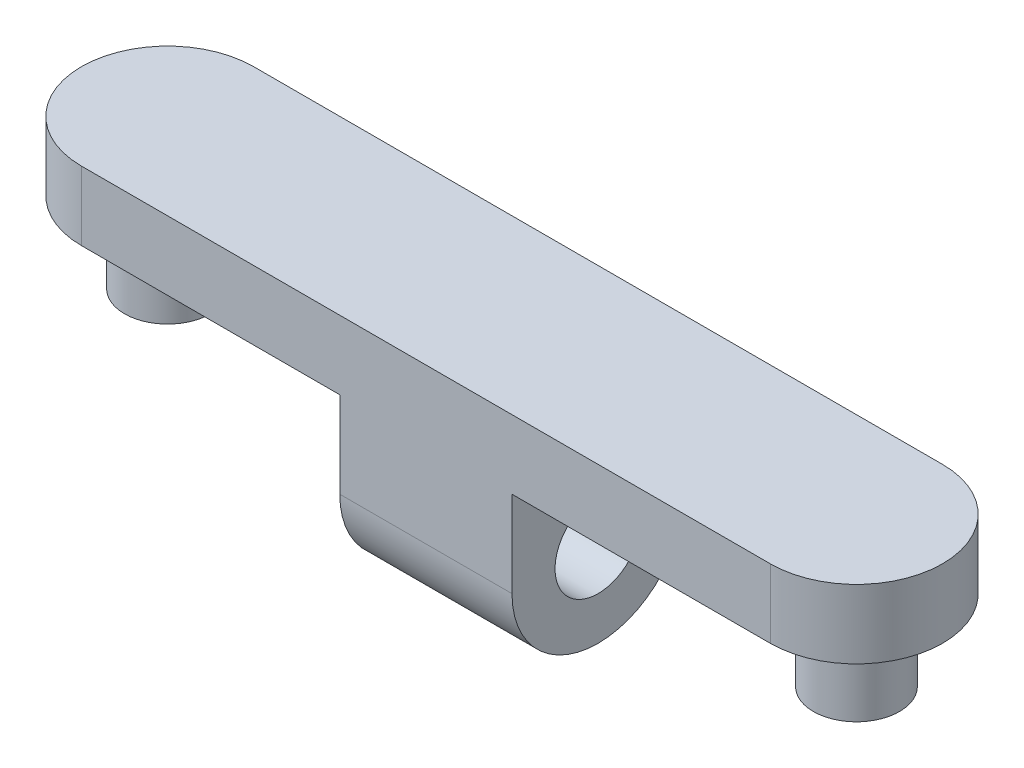
ISO-10303-21;
HEADER;
FILE_DESCRIPTION(('STEP AP214'),'2;1');
FILE_NAME('part.step','',(''),(''),'','','');
FILE_SCHEMA(('AUTOMOTIVE_DESIGN { 1 0 10303 214 1 1 1 1 }'));
ENDSEC;
DATA;
#1=APPLICATION_CONTEXT('core data for automotive mechanical design processes');
#2=APPLICATION_PROTOCOL_DEFINITION('international standard','automotive_design',2000,#1);
#3=PRODUCT_CONTEXT('',#1,'mechanical');
#4=PRODUCT('Part','Part','',(#3));
#5=PRODUCT_RELATED_PRODUCT_CATEGORY('part','',(#4));
#6=PRODUCT_DEFINITION_FORMATION('','',#4);
#7=PRODUCT_DEFINITION_CONTEXT('part definition',#1,'design');
#8=PRODUCT_DEFINITION('design','',#6,#7);
#9=PRODUCT_DEFINITION_SHAPE('','',#8);
#10=(LENGTH_UNIT() NAMED_UNIT(*) SI_UNIT(.MILLI.,.METRE.));
#11=(NAMED_UNIT(*) PLANE_ANGLE_UNIT() SI_UNIT($,.RADIAN.));
#12=(NAMED_UNIT(*) SI_UNIT($,.STERADIAN.) SOLID_ANGLE_UNIT());
#13=UNCERTAINTY_MEASURE_WITH_UNIT(LENGTH_MEASURE(1.E-05),#10,'distance_accuracy_value','');
#14=(GEOMETRIC_REPRESENTATION_CONTEXT(3) GLOBAL_UNCERTAINTY_ASSIGNED_CONTEXT((#13)) GLOBAL_UNIT_ASSIGNED_CONTEXT((#10,
#11,#12)) REPRESENTATION_CONTEXT('',''));
#15=CARTESIAN_POINT('',(0.,0.,0.));
#16=DIRECTION('',(0.,0.,1.));
#17=DIRECTION('',(1.,0.,0.));
#18=AXIS2_PLACEMENT_3D('',#15,#16,#17);
#19=CARTESIAN_POINT('',(-12.7,0.,0.));
#20=DIRECTION('',(0.,1.,0.));
#21=DIRECTION('',(0.,0.,1.));
#22=AXIS2_PLACEMENT_3D('',#19,#20,#21);
#23=PLANE('',#22);
#24=CARTESIAN_POINT('',(12.7,0.,0.));
#25=DIRECTION('',(0.,1.,0.));
#26=DIRECTION('',(0.,0.,1.));
#27=AXIS2_PLACEMENT_3D('',#24,#25,#26);
#28=CIRCLE('',#27,1.5875);
#29=CARTESIAN_POINT('',(12.7,0.,1.5875));
#30=VERTEX_POINT('',#29);
#31=EDGE_CURVE('E154',#30,#30,#28,.T.);
#32=ORIENTED_EDGE('',*,*,#31,.T.);
#33=EDGE_LOOP('',(#32));
#34=FACE_BOUND('',#33,.T.);
#35=DIRECTION('',(0.,0.,1.));
#36=VECTOR('',#35,1.);
#37=CARTESIAN_POINT('',(3.175,0.,-3.175));
#38=LINE('',#37,#36);
#39=CARTESIAN_POINT('',(3.175,0.,-3.175));
#40=VERTEX_POINT('',#39);
#41=CARTESIAN_POINT('',(3.17499999999999,0.,3.175));
#42=VERTEX_POINT('',#41);
#43=EDGE_CURVE('E111',#40,#42,#38,.T.);
#44=ORIENTED_EDGE('',*,*,#43,.F.);
#45=DIRECTION('',(1.,0.,0.));
#46=VECTOR('',#45,1.);
#47=CARTESIAN_POINT('',(-12.7,0.,-3.175));
#48=LINE('',#47,#46);
#49=CARTESIAN_POINT('',(12.7,0.,-3.17500000000001));
#50=VERTEX_POINT('',#49);
#51=EDGE_CURVE('E119',#40,#50,#48,.T.);
#52=ORIENTED_EDGE('',*,*,#51,.T.);
#53=CARTESIAN_POINT('',(12.7,0.,0.));
#54=DIRECTION('',(0.,1.,0.));
#55=DIRECTION('',(0.,0.,1.));
#56=AXIS2_PLACEMENT_3D('',#53,#54,#55);
#57=CIRCLE('',#56,3.175);
#58=CARTESIAN_POINT('',(12.7,0.,3.175));
#59=VERTEX_POINT('',#58);
#60=EDGE_CURVE('E129',#59,#50,#57,.T.);
#61=ORIENTED_EDGE('',*,*,#60,.F.);
#62=DIRECTION('',(1.,0.,0.));
#63=VECTOR('',#62,1.);
#64=CARTESIAN_POINT('',(-12.7,0.,3.175));
#65=LINE('',#64,#63);
#66=EDGE_CURVE('E132',#42,#59,#65,.T.);
#67=ORIENTED_EDGE('',*,*,#66,.F.);
#68=EDGE_LOOP('',(#44,#52,#61,#67));
#69=FACE_BOUND('',#68,.T.);
#70=ADVANCED_FACE('F40',(#34,#69),#23,.F.);
#71=CARTESIAN_POINT('',(-12.7,0.,0.));
#72=DIRECTION('',(0.,1.,0.));
#73=DIRECTION('',(0.,0.,1.));
#74=AXIS2_PLACEMENT_3D('',#71,#72,#73);
#75=CIRCLE('',#74,1.5875);
#76=CARTESIAN_POINT('',(-12.7,0.,1.5875));
#77=VERTEX_POINT('',#76);
#78=EDGE_CURVE('E158',#77,#77,#75,.T.);
#79=ORIENTED_EDGE('',*,*,#78,.T.);
#80=EDGE_LOOP('',(#79));
#81=FACE_BOUND('',#80,.T.);
#82=DIRECTION('',(0.,0.,-1.));
#83=VECTOR('',#82,1.);
#84=CARTESIAN_POINT('',(-3.175,0.,-3.175));
#85=LINE('',#84,#83);
#86=CARTESIAN_POINT('',(-3.175,0.,3.175));
#87=VERTEX_POINT('',#86);
#88=CARTESIAN_POINT('',(-3.175,0.,-3.17500000000001));
#89=VERTEX_POINT('',#88);
#90=EDGE_CURVE('E116',#87,#89,#85,.T.);
#91=ORIENTED_EDGE('',*,*,#90,.F.);
#92=CARTESIAN_POINT('',(-12.7,0.,3.175));
#93=VERTEX_POINT('',#92);
#94=EDGE_CURVE('E187',#93,#87,#65,.T.);
#95=ORIENTED_EDGE('',*,*,#94,.F.);
#96=CARTESIAN_POINT('',(-12.7,0.,0.));
#97=DIRECTION('',(0.,1.,0.));
#98=DIRECTION('',(0.,0.,1.));
#99=AXIS2_PLACEMENT_3D('',#96,#97,#98);
#100=CIRCLE('',#99,3.175);
#101=CARTESIAN_POINT('',(-12.7,0.,-3.175));
#102=VERTEX_POINT('',#101);
#103=EDGE_CURVE('E166',#102,#93,#100,.T.);
#104=ORIENTED_EDGE('',*,*,#103,.F.);
#105=EDGE_CURVE('E128',#102,#89,#48,.T.);
#106=ORIENTED_EDGE('',*,*,#105,.T.);
#107=EDGE_LOOP('',(#91,#95,#104,#106));
#108=FACE_BOUND('',#107,.T.);
#109=ADVANCED_FACE('F239',(#81,#108),#23,.F.);
#110=CARTESIAN_POINT('',(-12.7,2.54,0.));
#111=DIRECTION('',(0.,-1.,0.));
#112=DIRECTION('',(0.,0.,-1.));
#113=AXIS2_PLACEMENT_3D('',#110,#111,#112);
#114=CYLINDRICAL_SURFACE('',#113,3.175);
#115=ORIENTED_EDGE('',*,*,#103,.T.);
#116=DIRECTION('',(0.,-1.,0.));
#117=VECTOR('',#116,1.);
#118=CARTESIAN_POINT('',(-12.7,2.54,3.175));
#119=LINE('',#118,#117);
#120=CARTESIAN_POINT('',(-12.7,2.54,3.175));
#121=VERTEX_POINT('',#120);
#122=EDGE_CURVE('E203',#121,#93,#119,.T.);
#123=ORIENTED_EDGE('',*,*,#122,.F.);
#124=CARTESIAN_POINT('',(-12.7,2.54,0.));
#125=DIRECTION('',(0.,1.,0.));
#126=DIRECTION('',(0.,0.,1.));
#127=AXIS2_PLACEMENT_3D('',#124,#125,#126);
#128=CIRCLE('',#127,3.175);
#129=CARTESIAN_POINT('',(-12.7,2.54,-3.175));
#130=VERTEX_POINT('',#129);
#131=EDGE_CURVE('E170',#130,#121,#128,.T.);
#132=ORIENTED_EDGE('',*,*,#131,.F.);
#133=DIRECTION('',(0.,-1.,0.));
#134=VECTOR('',#133,1.);
#135=CARTESIAN_POINT('',(-12.7,2.54,-3.175));
#136=LINE('',#135,#134);
#137=EDGE_CURVE('E183',#130,#102,#136,.T.);
#138=ORIENTED_EDGE('',*,*,#137,.T.);
#139=EDGE_LOOP('',(#115,#123,#132,#138));
#140=FACE_BOUND('',#139,.T.);
#141=ADVANCED_FACE('F235',(#140),#114,.T.);
#142=CARTESIAN_POINT('',(-12.7,2.54,3.175));
#143=DIRECTION('',(0.,0.,-1.));
#144=DIRECTION('',(-1.,0.,0.));
#145=AXIS2_PLACEMENT_3D('',#142,#143,#144);
#146=PLANE('',#145);
#147=DIRECTION('',(0.,1.,0.));
#148=VECTOR('',#147,1.);
#149=CARTESIAN_POINT('',(-3.175,-6.35,3.175));
#150=LINE('',#149,#148);
#151=CARTESIAN_POINT('',(-3.175,-3.175,3.175));
#152=VERTEX_POINT('',#151);
#153=EDGE_CURVE('E147',#152,#87,#150,.T.);
#154=ORIENTED_EDGE('',*,*,#153,.F.);
#155=DIRECTION('',(-1.,0.,0.));
#156=VECTOR('',#155,1.);
#157=CARTESIAN_POINT('',(-12.7,-3.175,3.175));
#158=LINE('',#157,#156);
#159=CARTESIAN_POINT('',(3.175,-3.175,3.175));
#160=VERTEX_POINT('',#159);
#161=EDGE_CURVE('E213',#152,#160,#158,.F.);
#162=ORIENTED_EDGE('',*,*,#161,.T.);
#163=DIRECTION('',(0.,1.,0.));
#164=VECTOR('',#163,1.);
#165=CARTESIAN_POINT('',(3.175,-6.35,3.175));
#166=LINE('',#165,#164);
#167=EDGE_CURVE('E150',#160,#42,#166,.T.);
#168=ORIENTED_EDGE('',*,*,#167,.T.);
#169=ORIENTED_EDGE('',*,*,#66,.T.);
#170=DIRECTION('',(0.,-1.,0.));
#171=VECTOR('',#170,1.);
#172=CARTESIAN_POINT('',(12.7,2.54,3.175));
#173=LINE('',#172,#171);
#174=CARTESIAN_POINT('',(12.7,2.54,3.175));
#175=VERTEX_POINT('',#174);
#176=EDGE_CURVE('E199',#175,#59,#173,.T.);
#177=ORIENTED_EDGE('',*,*,#176,.F.);
#178=DIRECTION('',(1.,0.,0.));
#179=VECTOR('',#178,1.);
#180=CARTESIAN_POINT('',(-12.7,2.54,3.175));
#181=LINE('',#180,#179);
#182=EDGE_CURVE('E174',#121,#175,#181,.T.);
#183=ORIENTED_EDGE('',*,*,#182,.F.);
#184=ORIENTED_EDGE('',*,*,#122,.T.);
#185=ORIENTED_EDGE('',*,*,#94,.T.);
#186=EDGE_LOOP('',(#154,#162,#168,#169,#177,#183,#184,#185));
#187=FACE_BOUND('',#186,.T.);
#188=ADVANCED_FACE('F224',(#187),#146,.F.);
#189=CARTESIAN_POINT('',(12.7,2.54,0.));
#190=DIRECTION('',(0.,-1.,0.));
#191=DIRECTION('',(0.,0.,-1.));
#192=AXIS2_PLACEMENT_3D('',#189,#190,#191);
#193=CYLINDRICAL_SURFACE('',#192,3.175);
#194=ORIENTED_EDGE('',*,*,#60,.T.);
#195=DIRECTION('',(0.,-1.,0.));
#196=VECTOR('',#195,1.);
#197=CARTESIAN_POINT('',(12.7,2.54,-3.17500000000001));
#198=LINE('',#197,#196);
#199=CARTESIAN_POINT('',(12.7,2.54,-3.17500000000001));
#200=VERTEX_POINT('',#199);
#201=EDGE_CURVE('E123',#200,#50,#198,.T.);
#202=ORIENTED_EDGE('',*,*,#201,.F.);
#203=CARTESIAN_POINT('',(12.7,2.54,0.));
#204=DIRECTION('',(0.,1.,0.));
#205=DIRECTION('',(0.,0.,1.));
#206=AXIS2_PLACEMENT_3D('',#203,#204,#205);
#207=CIRCLE('',#206,3.175);
#208=EDGE_CURVE('E177',#175,#200,#207,.T.);
#209=ORIENTED_EDGE('',*,*,#208,.F.);
#210=ORIENTED_EDGE('',*,*,#176,.T.);
#211=EDGE_LOOP('',(#194,#202,#209,#210));
#212=FACE_BOUND('',#211,.T.);
#213=ADVANCED_FACE('F227',(#212),#193,.T.);
#214=CARTESIAN_POINT('',(-12.7,2.54,-3.175));
#215=DIRECTION('',(0.,0.,-1.));
#216=DIRECTION('',(-1.,0.,0.));
#217=AXIS2_PLACEMENT_3D('',#214,#215,#216);
#218=PLANE('',#217);
#219=DIRECTION('',(0.,1.,0.));
#220=VECTOR('',#219,1.);
#221=CARTESIAN_POINT('',(3.175,-6.35,-3.175));
#222=LINE('',#221,#220);
#223=CARTESIAN_POINT('',(3.175,-3.175,-3.175));
#224=VERTEX_POINT('',#223);
#225=EDGE_CURVE('E107',#224,#40,#222,.T.);
#226=ORIENTED_EDGE('',*,*,#225,.F.);
#227=DIRECTION('',(1.,0.,0.));
#228=VECTOR('',#227,1.);
#229=CARTESIAN_POINT('',(-3.175,-3.175,-3.17500000000001));
#230=LINE('',#229,#228);
#231=CARTESIAN_POINT('',(-3.175,-3.175,-3.175));
#232=VERTEX_POINT('',#231);
#233=EDGE_CURVE('E11',#224,#232,#230,.F.);
#234=ORIENTED_EDGE('',*,*,#233,.T.);
#235=DIRECTION('',(0.,1.,0.));
#236=VECTOR('',#235,1.);
#237=CARTESIAN_POINT('',(-3.175,-6.35,-3.175));
#238=LINE('',#237,#236);
#239=EDGE_CURVE('E115',#232,#89,#238,.T.);
#240=ORIENTED_EDGE('',*,*,#239,.T.);
#241=ORIENTED_EDGE('',*,*,#105,.F.);
#242=ORIENTED_EDGE('',*,*,#137,.F.);
#243=DIRECTION('',(1.,0.,0.));
#244=VECTOR('',#243,1.);
#245=CARTESIAN_POINT('',(-12.7,2.54,-3.175));
#246=LINE('',#245,#244);
#247=EDGE_CURVE('E180',#130,#200,#246,.T.);
#248=ORIENTED_EDGE('',*,*,#247,.T.);
#249=ORIENTED_EDGE('',*,*,#201,.T.);
#250=ORIENTED_EDGE('',*,*,#51,.F.);
#251=EDGE_LOOP('',(#226,#234,#240,#241,#242,#248,#249,#250));
#252=FACE_BOUND('',#251,.T.);
#253=ADVANCED_FACE('F120',(#252),#218,.T.);
#254=CARTESIAN_POINT('',(-12.7,2.54,0.));
#255=DIRECTION('',(0.,1.,0.));
#256=DIRECTION('',(0.,0.,1.));
#257=AXIS2_PLACEMENT_3D('',#254,#255,#256);
#258=PLANE('',#257);
#259=ORIENTED_EDGE('',*,*,#131,.T.);
#260=ORIENTED_EDGE('',*,*,#182,.T.);
#261=ORIENTED_EDGE('',*,*,#208,.T.);
#262=ORIENTED_EDGE('',*,*,#247,.F.);
#263=EDGE_LOOP('',(#259,#260,#261,#262));
#264=FACE_BOUND('',#263,.T.);
#265=ADVANCED_FACE('F230',(#264),#258,.T.);
#266=CARTESIAN_POINT('',(-12.7,-2.9718,0.));
#267=DIRECTION('',(0.,1.,0.));
#268=DIRECTION('',(0.,0.,1.));
#269=AXIS2_PLACEMENT_3D('',#266,#267,#268);
#270=CYLINDRICAL_SURFACE('',#269,1.5875);
#271=CARTESIAN_POINT('',(-12.7,-2.9718,0.));
#272=DIRECTION('',(0.,1.,0.));
#273=DIRECTION('',(0.,0.,1.));
#274=AXIS2_PLACEMENT_3D('',#271,#272,#273);
#275=CIRCLE('',#274,1.5875);
#276=CARTESIAN_POINT('',(-12.7,-2.9718,1.5875));
#277=VERTEX_POINT('',#276);
#278=EDGE_CURVE('E162',#277,#277,#275,.T.);
#279=ORIENTED_EDGE('',*,*,#278,.T.);
#280=EDGE_LOOP('',(#279));
#281=FACE_BOUND('',#280,.T.);
#282=ORIENTED_EDGE('',*,*,#78,.F.);
#283=EDGE_LOOP('',(#282));
#284=FACE_BOUND('',#283,.T.);
#285=ADVANCED_FACE('F287',(#281,#284),#270,.T.);
#286=CARTESIAN_POINT('',(-12.7,-2.9718,0.));
#287=DIRECTION('',(0.,1.,0.));
#288=DIRECTION('',(0.,0.,1.));
#289=AXIS2_PLACEMENT_3D('',#286,#287,#288);
#290=PLANE('',#289);
#291=ORIENTED_EDGE('',*,*,#278,.F.);
#292=EDGE_LOOP('',(#291));
#293=FACE_BOUND('',#292,.T.);
#294=ADVANCED_FACE('F293',(#293),#290,.F.);
#295=CARTESIAN_POINT('',(12.7,-2.9718,0.));
#296=DIRECTION('',(0.,1.,0.));
#297=DIRECTION('',(0.,0.,1.));
#298=AXIS2_PLACEMENT_3D('',#295,#296,#297);
#299=CYLINDRICAL_SURFACE('',#298,1.5875);
#300=CARTESIAN_POINT('',(12.7,-2.9718,0.));
#301=DIRECTION('',(0.,1.,0.));
#302=DIRECTION('',(0.,0.,1.));
#303=AXIS2_PLACEMENT_3D('',#300,#301,#302);
#304=CIRCLE('',#303,1.5875);
#305=CARTESIAN_POINT('',(12.7,-2.9718,1.5875));
#306=VERTEX_POINT('',#305);
#307=EDGE_CURVE('E153',#306,#306,#304,.T.);
#308=ORIENTED_EDGE('',*,*,#307,.T.);
#309=EDGE_LOOP('',(#308));
#310=FACE_BOUND('',#309,.T.);
#311=ORIENTED_EDGE('',*,*,#31,.F.);
#312=EDGE_LOOP('',(#311));
#313=FACE_BOUND('',#312,.T.);
#314=ADVANCED_FACE('F300',(#310,#313),#299,.T.);
#315=CARTESIAN_POINT('',(12.7,-2.9718,0.));
#316=DIRECTION('',(0.,1.,0.));
#317=DIRECTION('',(0.,0.,1.));
#318=AXIS2_PLACEMENT_3D('',#315,#316,#317);
#319=PLANE('',#318);
#320=ORIENTED_EDGE('',*,*,#307,.F.);
#321=EDGE_LOOP('',(#320));
#322=FACE_BOUND('',#321,.T.);
#323=ADVANCED_FACE('F308',(#322),#319,.F.);
#324=CARTESIAN_POINT('',(3.175,-6.35,-3.175));
#325=DIRECTION('',(-1.,0.,0.));
#326=DIRECTION('',(0.,0.,1.));
#327=AXIS2_PLACEMENT_3D('',#324,#325,#326);
#328=PLANE('',#327);
#329=CARTESIAN_POINT('',(3.175,-3.175,0.));
#330=DIRECTION('',(1.,0.,0.));
#331=DIRECTION('',(0.,0.,-1.));
#332=AXIS2_PLACEMENT_3D('',#329,#330,#331);
#333=CIRCLE('',#332,1.5875);
#334=CARTESIAN_POINT('',(3.175,-3.175,-1.5875));
#335=VERTEX_POINT('',#334);
#336=EDGE_CURVE('E141',#335,#335,#333,.T.);
#337=ORIENTED_EDGE('',*,*,#336,.F.);
#338=EDGE_LOOP('',(#337));
#339=FACE_BOUND('',#338,.T.);
#340=ORIENTED_EDGE('',*,*,#167,.F.);
#341=CARTESIAN_POINT('',(3.175,-3.175,0.));
#342=DIRECTION('',(-1.,0.,0.));
#343=DIRECTION('',(0.,0.,1.));
#344=AXIS2_PLACEMENT_3D('',#341,#342,#343);
#345=CIRCLE('',#344,3.175);
#346=CARTESIAN_POINT('',(3.175,-6.35,0.));
#347=VERTEX_POINT('',#346);
#348=EDGE_CURVE('E50',#160,#347,#345,.F.);
#349=ORIENTED_EDGE('',*,*,#348,.T.);
#350=CARTESIAN_POINT('',(3.175,-3.175,0.));
#351=DIRECTION('',(-1.,0.,0.));
#352=DIRECTION('',(0.,0.,1.));
#353=AXIS2_PLACEMENT_3D('',#350,#351,#352);
#354=CIRCLE('',#353,3.175);
#355=EDGE_CURVE('E57',#347,#224,#354,.F.);
#356=ORIENTED_EDGE('',*,*,#355,.T.);
#357=ORIENTED_EDGE('',*,*,#225,.T.);
#358=ORIENTED_EDGE('',*,*,#43,.T.);
#359=EDGE_LOOP('',(#340,#349,#356,#357,#358));
#360=FACE_BOUND('',#359,.T.);
#361=ADVANCED_FACE('F109',(#339,#360),#328,.F.);
#362=CARTESIAN_POINT('',(-3.175,-6.35,-3.175));
#363=DIRECTION('',(1.,0.,0.));
#364=DIRECTION('',(0.,0.,-1.));
#365=AXIS2_PLACEMENT_3D('',#362,#363,#364);
#366=PLANE('',#365);
#367=CARTESIAN_POINT('',(-3.175,-3.175,0.));
#368=DIRECTION('',(1.,0.,0.));
#369=DIRECTION('',(0.,0.,-1.));
#370=AXIS2_PLACEMENT_3D('',#367,#368,#369);
#371=CIRCLE('',#370,1.5875);
#372=CARTESIAN_POINT('',(-3.175,-3.175,-1.5875));
#373=VERTEX_POINT('',#372);
#374=EDGE_CURVE('E134',#373,#373,#371,.T.);
#375=ORIENTED_EDGE('',*,*,#374,.T.);
#376=EDGE_LOOP('',(#375));
#377=FACE_BOUND('',#376,.T.);
#378=CARTESIAN_POINT('',(-3.175,-3.175,0.));
#379=DIRECTION('',(1.,0.,0.));
#380=DIRECTION('',(0.,0.,-1.));
#381=AXIS2_PLACEMENT_3D('',#378,#379,#380);
#382=CIRCLE('',#381,3.175);
#383=CARTESIAN_POINT('',(-3.175,-6.35,0.));
#384=VERTEX_POINT('',#383);
#385=EDGE_CURVE('E207',#232,#384,#382,.F.);
#386=ORIENTED_EDGE('',*,*,#385,.T.);
#387=CARTESIAN_POINT('',(-3.175,-3.175,0.));
#388=DIRECTION('',(1.,0.,0.));
#389=DIRECTION('',(0.,0.,-1.));
#390=AXIS2_PLACEMENT_3D('',#387,#388,#389);
#391=CIRCLE('',#390,3.175);
#392=EDGE_CURVE('E210',#384,#152,#391,.F.);
#393=ORIENTED_EDGE('',*,*,#392,.T.);
#394=ORIENTED_EDGE('',*,*,#153,.T.);
#395=ORIENTED_EDGE('',*,*,#90,.T.);
#396=ORIENTED_EDGE('',*,*,#239,.F.);
#397=EDGE_LOOP('',(#386,#393,#394,#395,#396));
#398=FACE_BOUND('',#397,.T.);
#399=ADVANCED_FACE('F243',(#377,#398),#366,.F.);
#400=CARTESIAN_POINT('',(-3.175,-3.175,0.));
#401=DIRECTION('',(1.,0.,0.));
#402=DIRECTION('',(0.,0.,-1.));
#403=AXIS2_PLACEMENT_3D('',#400,#401,#402);
#404=CYLINDRICAL_SURFACE('',#403,1.5875);
#405=ORIENTED_EDGE('',*,*,#374,.F.);
#406=EDGE_LOOP('',(#405));
#407=FACE_BOUND('',#406,.T.);
#408=ORIENTED_EDGE('',*,*,#336,.T.);
#409=EDGE_LOOP('',(#408));
#410=FACE_BOUND('',#409,.T.);
#411=ADVANCED_FACE('F256',(#407,#410),#404,.F.);
#412=CARTESIAN_POINT('',(0.,-3.175,0.));
#413=DIRECTION('',(-1.,0.,0.));
#414=DIRECTION('',(0.,0.,1.));
#415=AXIS2_PLACEMENT_3D('',#412,#413,#414);
#416=CYLINDRICAL_SURFACE('',#415,3.175);
#417=ORIENTED_EDGE('',*,*,#233,.F.);
#418=ORIENTED_EDGE('',*,*,#355,.F.);
#419=DIRECTION('',(1.,0.,0.));
#420=VECTOR('',#419,1.);
#421=CARTESIAN_POINT('',(3.175,-6.35,0.));
#422=LINE('',#421,#420);
#423=EDGE_CURVE('E44',#384,#347,#422,.T.);
#424=ORIENTED_EDGE('',*,*,#423,.F.);
#425=ORIENTED_EDGE('',*,*,#385,.F.);
#426=EDGE_LOOP('',(#417,#418,#424,#425));
#427=FACE_BOUND('',#426,.T.);
#428=ADVANCED_FACE('F42',(#427),#416,.T.);
#429=CARTESIAN_POINT('',(0.,-3.175,0.));
#430=DIRECTION('',(-1.,0.,0.));
#431=DIRECTION('',(0.,0.,1.));
#432=AXIS2_PLACEMENT_3D('',#429,#430,#431);
#433=CYLINDRICAL_SURFACE('',#432,3.175);
#434=ORIENTED_EDGE('',*,*,#348,.F.);
#435=ORIENTED_EDGE('',*,*,#161,.F.);
#436=ORIENTED_EDGE('',*,*,#392,.F.);
#437=ORIENTED_EDGE('',*,*,#423,.T.);
#438=EDGE_LOOP('',(#434,#435,#436,#437));
#439=FACE_BOUND('',#438,.T.);
#440=ADVANCED_FACE('F251',(#439),#433,.T.);
#441=CLOSED_SHELL('',(#70,#109,#141,#188,#213,#253,#265,#285,#294,#314,#323,#361,#399,#411,#428,#440));
#442=MANIFOLD_SOLID_BREP('B2',#441);
#443=ADVANCED_BREP_SHAPE_REPRESENTATION('',(#18,#442),#14);
#444=SHAPE_DEFINITION_REPRESENTATION(#9,#443);
ENDSEC;
END-ISO-10303-21;
